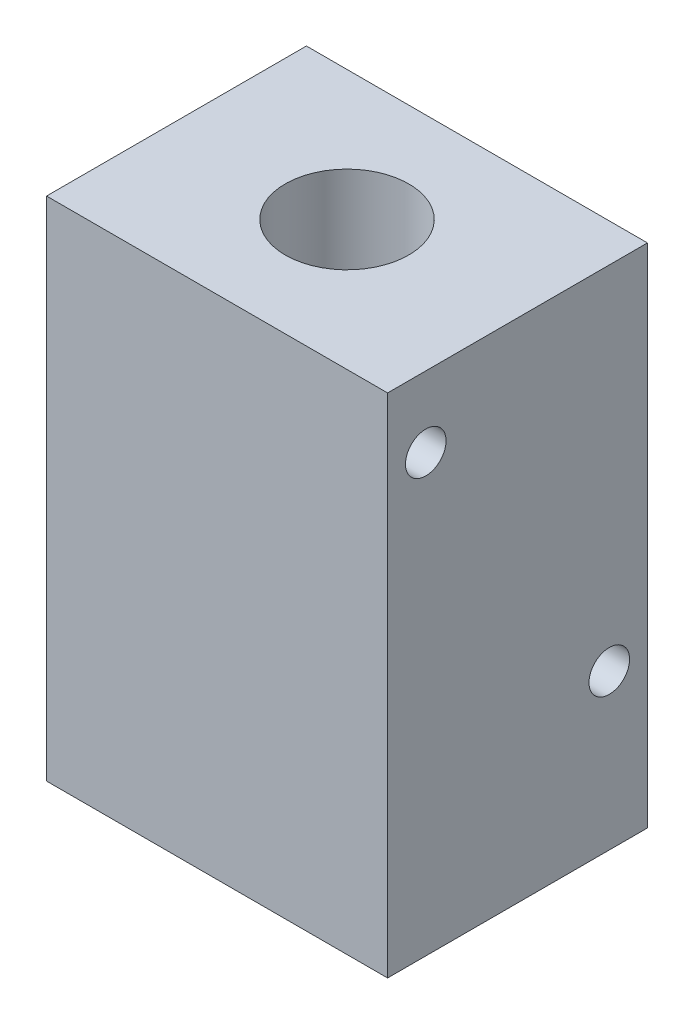
ISO-10303-21;
HEADER;
FILE_DESCRIPTION(('STEP AP214'),'2;1');
FILE_NAME('part.step','',(''),(''),'','','');
FILE_SCHEMA(('AUTOMOTIVE_DESIGN { 1 0 10303 214 1 1 1 1 }'));
ENDSEC;
DATA;
#1=APPLICATION_CONTEXT('core data for automotive mechanical design processes');
#2=APPLICATION_PROTOCOL_DEFINITION('international standard','automotive_design',2000,#1);
#3=PRODUCT_CONTEXT('',#1,'mechanical');
#4=PRODUCT('Part','Part','',(#3));
#5=PRODUCT_RELATED_PRODUCT_CATEGORY('part','',(#4));
#6=PRODUCT_DEFINITION_FORMATION('','',#4);
#7=PRODUCT_DEFINITION_CONTEXT('part definition',#1,'design');
#8=PRODUCT_DEFINITION('design','',#6,#7);
#9=PRODUCT_DEFINITION_SHAPE('','',#8);
#10=(LENGTH_UNIT() NAMED_UNIT(*) SI_UNIT(.MILLI.,.METRE.));
#11=(NAMED_UNIT(*) PLANE_ANGLE_UNIT() SI_UNIT($,.RADIAN.));
#12=(NAMED_UNIT(*) SI_UNIT($,.STERADIAN.) SOLID_ANGLE_UNIT());
#13=UNCERTAINTY_MEASURE_WITH_UNIT(LENGTH_MEASURE(1.E-05),#10,'distance_accuracy_value','');
#14=(GEOMETRIC_REPRESENTATION_CONTEXT(3) GLOBAL_UNCERTAINTY_ASSIGNED_CONTEXT((#13)) GLOBAL_UNIT_ASSIGNED_CONTEXT((#10,
#11,#12)) REPRESENTATION_CONTEXT('',''));
#15=CARTESIAN_POINT('',(0.,0.,0.));
#16=DIRECTION('',(0.,0.,1.));
#17=DIRECTION('',(1.,0.,0.));
#18=AXIS2_PLACEMENT_3D('',#15,#16,#17);
#19=CARTESIAN_POINT('',(13.335,39.624,-10.16));
#20=DIRECTION('',(0.,-1.,0.));
#21=DIRECTION('',(0.,0.,-1.));
#22=AXIS2_PLACEMENT_3D('',#19,#20,#21);
#23=CYLINDRICAL_SURFACE('',#22,2.413);
#24=CARTESIAN_POINT('',(13.335,0.,-10.16));
#25=DIRECTION('',(0.,-1.,0.));
#26=DIRECTION('',(0.,0.,-1.));
#27=AXIS2_PLACEMENT_3D('',#24,#25,#26);
#28=CIRCLE('',#27,2.413);
#29=CARTESIAN_POINT('',(13.335,0.,-12.573));
#30=VERTEX_POINT('',#29);
#31=EDGE_CURVE('E118',#30,#30,#28,.T.);
#32=ORIENTED_EDGE('',*,*,#31,.T.);
#33=EDGE_LOOP('',(#32));
#34=FACE_BOUND('',#33,.T.);
#35=CARTESIAN_POINT('',(13.335,11.176,-10.16));
#36=DIRECTION('',(0.,1.,0.));
#37=DIRECTION('',(0.,0.,1.));
#38=AXIS2_PLACEMENT_3D('',#35,#36,#37);
#39=CIRCLE('',#38,2.413);
#40=CARTESIAN_POINT('',(13.335,11.176,-7.747));
#41=VERTEX_POINT('',#40);
#42=EDGE_CURVE('E47',#41,#41,#39,.F.);
#43=ORIENTED_EDGE('',*,*,#42,.F.);
#44=EDGE_LOOP('',(#43));
#45=FACE_BOUND('',#44,.T.);
#46=ADVANCED_FACE('F43',(#34,#45),#23,.F.);
#47=CARTESIAN_POINT('',(0.,39.624,0.));
#48=DIRECTION('',(1.,0.,0.));
#49=DIRECTION('',(0.,0.,-1.));
#50=AXIS2_PLACEMENT_3D('',#47,#48,#49);
#51=PLANE('',#50);
#52=DIRECTION('',(0.,0.,1.));
#53=VECTOR('',#52,1.);
#54=CARTESIAN_POINT('',(0.,0.,0.));
#55=LINE('',#54,#53);
#56=CARTESIAN_POINT('',(0.,0.,-20.32));
#57=VERTEX_POINT('',#56);
#58=CARTESIAN_POINT('',(0.,0.,0.));
#59=VERTEX_POINT('',#58);
#60=EDGE_CURVE('E114',#57,#59,#55,.T.);
#61=ORIENTED_EDGE('',*,*,#60,.T.);
#62=DIRECTION('',(0.,-1.,0.));
#63=VECTOR('',#62,1.);
#64=CARTESIAN_POINT('',(0.,39.624,0.));
#65=LINE('',#64,#63);
#66=CARTESIAN_POINT('',(0.,39.624,0.));
#67=VERTEX_POINT('',#66);
#68=EDGE_CURVE('E11',#67,#59,#65,.T.);
#69=ORIENTED_EDGE('',*,*,#68,.F.);
#70=DIRECTION('',(0.,0.,1.));
#71=VECTOR('',#70,1.);
#72=CARTESIAN_POINT('',(0.,39.624,0.));
#73=LINE('',#72,#71);
#74=CARTESIAN_POINT('',(0.,39.624,-20.32));
#75=VERTEX_POINT('',#74);
#76=EDGE_CURVE('E97',#75,#67,#73,.T.);
#77=ORIENTED_EDGE('',*,*,#76,.F.);
#78=DIRECTION('',(0.,-1.,0.));
#79=VECTOR('',#78,1.);
#80=CARTESIAN_POINT('',(0.,39.624,-20.32));
#81=LINE('',#80,#79);
#82=EDGE_CURVE('E110',#75,#57,#81,.T.);
#83=ORIENTED_EDGE('',*,*,#82,.T.);
#84=EDGE_LOOP('',(#61,#69,#77,#83));
#85=FACE_BOUND('',#84,.T.);
#86=ADVANCED_FACE('F45',(#85),#51,.F.);
#87=CARTESIAN_POINT('',(0.,39.624,0.));
#88=DIRECTION('',(0.,0.,-1.));
#89=DIRECTION('',(-1.,0.,0.));
#90=AXIS2_PLACEMENT_3D('',#87,#88,#89);
#91=PLANE('',#90);
#92=DIRECTION('',(1.,0.,0.));
#93=VECTOR('',#92,1.);
#94=CARTESIAN_POINT('',(0.,0.,0.));
#95=LINE('',#94,#93);
#96=CARTESIAN_POINT('',(26.67,0.,0.));
#97=VERTEX_POINT('',#96);
#98=EDGE_CURVE('E102',#59,#97,#95,.T.);
#99=ORIENTED_EDGE('',*,*,#98,.T.);
#100=DIRECTION('',(0.,-1.,0.));
#101=VECTOR('',#100,1.);
#102=CARTESIAN_POINT('',(26.67,39.624,0.));
#103=LINE('',#102,#101);
#104=CARTESIAN_POINT('',(26.67,39.624,0.));
#105=VERTEX_POINT('',#104);
#106=EDGE_CURVE('E54',#105,#97,#103,.T.);
#107=ORIENTED_EDGE('',*,*,#106,.F.);
#108=DIRECTION('',(1.,0.,0.));
#109=VECTOR('',#108,1.);
#110=CARTESIAN_POINT('',(0.,39.624,0.));
#111=LINE('',#110,#109);
#112=EDGE_CURVE('E92',#67,#105,#111,.T.);
#113=ORIENTED_EDGE('',*,*,#112,.F.);
#114=ORIENTED_EDGE('',*,*,#68,.T.);
#115=EDGE_LOOP('',(#99,#107,#113,#114));
#116=FACE_BOUND('',#115,.T.);
#117=ADVANCED_FACE('F101',(#116),#91,.F.);
#118=CARTESIAN_POINT('',(26.67,39.624,0.));
#119=DIRECTION('',(-1.,0.,0.));
#120=DIRECTION('',(0.,0.,1.));
#121=AXIS2_PLACEMENT_3D('',#118,#119,#120);
#122=PLANE('',#121);
#123=CARTESIAN_POINT('',(26.67,34.0995,-2.9845));
#124=DIRECTION('',(1.,0.,0.));
#125=DIRECTION('',(0.,0.,-1.));
#126=AXIS2_PLACEMENT_3D('',#123,#124,#125);
#127=CIRCLE('',#126,1.5875);
#128=CARTESIAN_POINT('',(26.67,34.0995,-4.572));
#129=VERTEX_POINT('',#128);
#130=EDGE_CURVE('E155',#129,#129,#127,.T.);
#131=ORIENTED_EDGE('',*,*,#130,.F.);
#132=EDGE_LOOP('',(#131));
#133=FACE_BOUND('',#132,.T.);
#134=CARTESIAN_POINT('',(26.67,12.1285,-17.3355));
#135=DIRECTION('',(1.,0.,0.));
#136=DIRECTION('',(0.,0.,-1.));
#137=AXIS2_PLACEMENT_3D('',#134,#135,#136);
#138=CIRCLE('',#137,1.5875);
#139=CARTESIAN_POINT('',(26.67,12.1285,-18.923));
#140=VERTEX_POINT('',#139);
#141=EDGE_CURVE('E151',#140,#140,#138,.T.);
#142=ORIENTED_EDGE('',*,*,#141,.F.);
#143=EDGE_LOOP('',(#142));
#144=FACE_BOUND('',#143,.T.);
#145=DIRECTION('',(0.,0.,-1.));
#146=VECTOR('',#145,1.);
#147=CARTESIAN_POINT('',(26.67,0.,0.));
#148=LINE('',#147,#146);
#149=CARTESIAN_POINT('',(26.67,0.,-20.32));
#150=VERTEX_POINT('',#149);
#151=EDGE_CURVE('E79',#97,#150,#148,.T.);
#152=ORIENTED_EDGE('',*,*,#151,.T.);
#153=DIRECTION('',(0.,-1.,0.));
#154=VECTOR('',#153,1.);
#155=CARTESIAN_POINT('',(26.67,39.624,-20.32));
#156=LINE('',#155,#154);
#157=CARTESIAN_POINT('',(26.67,39.624,-20.32));
#158=VERTEX_POINT('',#157);
#159=EDGE_CURVE('E104',#158,#150,#156,.T.);
#160=ORIENTED_EDGE('',*,*,#159,.F.);
#161=DIRECTION('',(0.,0.,-1.));
#162=VECTOR('',#161,1.);
#163=CARTESIAN_POINT('',(26.67,39.624,0.));
#164=LINE('',#163,#162);
#165=EDGE_CURVE('E95',#105,#158,#164,.T.);
#166=ORIENTED_EDGE('',*,*,#165,.F.);
#167=ORIENTED_EDGE('',*,*,#106,.T.);
#168=EDGE_LOOP('',(#152,#160,#166,#167));
#169=FACE_BOUND('',#168,.T.);
#170=ADVANCED_FACE('F106',(#133,#144,#169),#122,.F.);
#171=CARTESIAN_POINT('',(0.,39.624,-20.32));
#172=DIRECTION('',(0.,0.,1.));
#173=DIRECTION('',(1.,0.,0.));
#174=AXIS2_PLACEMENT_3D('',#171,#172,#173);
#175=PLANE('',#174);
#176=DIRECTION('',(-1.,0.,0.));
#177=VECTOR('',#176,1.);
#178=CARTESIAN_POINT('',(0.,0.,-20.32));
#179=LINE('',#178,#177);
#180=EDGE_CURVE('E85',#150,#57,#179,.T.);
#181=ORIENTED_EDGE('',*,*,#180,.T.);
#182=ORIENTED_EDGE('',*,*,#82,.F.);
#183=DIRECTION('',(-1.,0.,0.));
#184=VECTOR('',#183,1.);
#185=CARTESIAN_POINT('',(0.,39.624,-20.32));
#186=LINE('',#185,#184);
#187=EDGE_CURVE('E62',#158,#75,#186,.T.);
#188=ORIENTED_EDGE('',*,*,#187,.F.);
#189=ORIENTED_EDGE('',*,*,#159,.T.);
#190=EDGE_LOOP('',(#181,#182,#188,#189));
#191=FACE_BOUND('',#190,.T.);
#192=ADVANCED_FACE('F128',(#191),#175,.F.);
#193=CARTESIAN_POINT('',(0.,39.624,0.));
#194=DIRECTION('',(0.,-1.,0.));
#195=DIRECTION('',(0.,0.,-1.));
#196=AXIS2_PLACEMENT_3D('',#193,#194,#195);
#197=PLANE('',#196);
#198=CARTESIAN_POINT('',(13.335,39.624,-10.16));
#199=DIRECTION('',(0.,1.,0.));
#200=DIRECTION('',(0.,0.,1.));
#201=AXIS2_PLACEMENT_3D('',#198,#199,#200);
#202=CIRCLE('',#201,4.826);
#203=CARTESIAN_POINT('',(13.335,39.624,-5.334));
#204=VERTEX_POINT('',#203);
#205=EDGE_CURVE('E138',#204,#204,#202,.T.);
#206=ORIENTED_EDGE('',*,*,#205,.F.);
#207=EDGE_LOOP('',(#206));
#208=FACE_BOUND('',#207,.T.);
#209=ORIENTED_EDGE('',*,*,#76,.T.);
#210=ORIENTED_EDGE('',*,*,#112,.T.);
#211=ORIENTED_EDGE('',*,*,#165,.T.);
#212=ORIENTED_EDGE('',*,*,#187,.T.);
#213=EDGE_LOOP('',(#209,#210,#211,#212));
#214=FACE_BOUND('',#213,.T.);
#215=ADVANCED_FACE('F93',(#208,#214),#197,.F.);
#216=CARTESIAN_POINT('',(0.,0.,0.));
#217=DIRECTION('',(0.,-1.,0.));
#218=DIRECTION('',(0.,0.,-1.));
#219=AXIS2_PLACEMENT_3D('',#216,#217,#218);
#220=PLANE('',#219);
#221=ORIENTED_EDGE('',*,*,#31,.F.);
#222=EDGE_LOOP('',(#221));
#223=FACE_BOUND('',#222,.T.);
#224=ORIENTED_EDGE('',*,*,#60,.F.);
#225=ORIENTED_EDGE('',*,*,#180,.F.);
#226=ORIENTED_EDGE('',*,*,#151,.F.);
#227=ORIENTED_EDGE('',*,*,#98,.F.);
#228=EDGE_LOOP('',(#224,#225,#226,#227));
#229=FACE_BOUND('',#228,.T.);
#230=ADVANCED_FACE('F131',(#223,#229),#220,.T.);
#231=CARTESIAN_POINT('',(13.335,11.176,-10.16));
#232=DIRECTION('',(0.,1.,0.));
#233=DIRECTION('',(0.,0.,1.));
#234=AXIS2_PLACEMENT_3D('',#231,#232,#233);
#235=PLANE('',#234);
#236=CARTESIAN_POINT('',(13.335,11.176,-10.16));
#237=DIRECTION('',(0.,1.,0.));
#238=DIRECTION('',(0.,0.,1.));
#239=AXIS2_PLACEMENT_3D('',#236,#237,#238);
#240=CIRCLE('',#239,4.826);
#241=CARTESIAN_POINT('',(13.335,11.176,-5.334));
#242=VERTEX_POINT('',#241);
#243=EDGE_CURVE('E142',#242,#242,#240,.T.);
#244=ORIENTED_EDGE('',*,*,#243,.T.);
#245=EDGE_LOOP('',(#244));
#246=FACE_BOUND('',#245,.T.);
#247=ORIENTED_EDGE('',*,*,#42,.T.);
#248=EDGE_LOOP('',(#247));
#249=FACE_BOUND('',#248,.T.);
#250=ADVANCED_FACE('F188',(#246,#249),#235,.T.);
#251=CARTESIAN_POINT('',(13.335,11.176,-10.16));
#252=DIRECTION('',(0.,1.,0.));
#253=DIRECTION('',(0.,0.,1.));
#254=AXIS2_PLACEMENT_3D('',#251,#252,#253);
#255=CYLINDRICAL_SURFACE('',#254,4.826);
#256=ORIENTED_EDGE('',*,*,#243,.F.);
#257=EDGE_LOOP('',(#256));
#258=FACE_BOUND('',#257,.T.);
#259=ORIENTED_EDGE('',*,*,#205,.T.);
#260=EDGE_LOOP('',(#259));
#261=FACE_BOUND('',#260,.T.);
#262=ADVANCED_FACE('F179',(#258,#261),#255,.F.);
#263=CARTESIAN_POINT('',(24.13,12.1285,-17.3355));
#264=DIRECTION('',(1.,0.,0.));
#265=DIRECTION('',(0.,0.,-1.));
#266=AXIS2_PLACEMENT_3D('',#263,#264,#265);
#267=CYLINDRICAL_SURFACE('',#266,1.5875);
#268=CARTESIAN_POINT('',(24.13,12.1285,-17.3355));
#269=DIRECTION('',(1.,0.,0.));
#270=DIRECTION('',(0.,0.,-1.));
#271=AXIS2_PLACEMENT_3D('',#268,#269,#270);
#272=CIRCLE('',#271,1.5875);
#273=CARTESIAN_POINT('',(24.13,12.1285,-18.923));
#274=VERTEX_POINT('',#273);
#275=EDGE_CURVE('E147',#274,#274,#272,.T.);
#276=ORIENTED_EDGE('',*,*,#275,.F.);
#277=EDGE_LOOP('',(#276));
#278=FACE_BOUND('',#277,.T.);
#279=ORIENTED_EDGE('',*,*,#141,.T.);
#280=EDGE_LOOP('',(#279));
#281=FACE_BOUND('',#280,.T.);
#282=ADVANCED_FACE('F177',(#278,#281),#267,.F.);
#283=CARTESIAN_POINT('',(24.13,12.1285,-17.3355));
#284=DIRECTION('',(1.,0.,0.));
#285=DIRECTION('',(0.,0.,-1.));
#286=AXIS2_PLACEMENT_3D('',#283,#284,#285);
#287=PLANE('',#286);
#288=ORIENTED_EDGE('',*,*,#275,.T.);
#289=EDGE_LOOP('',(#288));
#290=FACE_BOUND('',#289,.T.);
#291=ADVANCED_FACE('F168',(#290),#287,.T.);
#292=CARTESIAN_POINT('',(24.13,34.0995,-2.9845));
#293=DIRECTION('',(1.,0.,0.));
#294=DIRECTION('',(0.,0.,-1.));
#295=AXIS2_PLACEMENT_3D('',#292,#293,#294);
#296=CYLINDRICAL_SURFACE('',#295,1.5875);
#297=CARTESIAN_POINT('',(24.13,34.0995,-2.9845));
#298=DIRECTION('',(1.,0.,0.));
#299=DIRECTION('',(0.,0.,-1.));
#300=AXIS2_PLACEMENT_3D('',#297,#298,#299);
#301=CIRCLE('',#300,1.5875);
#302=CARTESIAN_POINT('',(24.13,34.0995,-4.572));
#303=VERTEX_POINT('',#302);
#304=EDGE_CURVE('E143',#303,#303,#301,.T.);
#305=ORIENTED_EDGE('',*,*,#304,.F.);
#306=EDGE_LOOP('',(#305));
#307=FACE_BOUND('',#306,.T.);
#308=ORIENTED_EDGE('',*,*,#130,.T.);
#309=EDGE_LOOP('',(#308));
#310=FACE_BOUND('',#309,.T.);
#311=ADVANCED_FACE('F165',(#307,#310),#296,.F.);
#312=CARTESIAN_POINT('',(24.13,34.0995,-2.9845));
#313=DIRECTION('',(1.,0.,0.));
#314=DIRECTION('',(0.,0.,-1.));
#315=AXIS2_PLACEMENT_3D('',#312,#313,#314);
#316=PLANE('',#315);
#317=ORIENTED_EDGE('',*,*,#304,.T.);
#318=EDGE_LOOP('',(#317));
#319=FACE_BOUND('',#318,.T.);
#320=ADVANCED_FACE('F163',(#319),#316,.T.);
#321=CLOSED_SHELL('',(#46,#86,#117,#170,#192,#215,#230,#250,#262,#282,#291,#311,#320));
#322=MANIFOLD_SOLID_BREP('B2',#321);
#323=ADVANCED_BREP_SHAPE_REPRESENTATION('',(#18,#322),#14);
#324=SHAPE_DEFINITION_REPRESENTATION(#9,#323);
ENDSEC;
END-ISO-10303-21;
